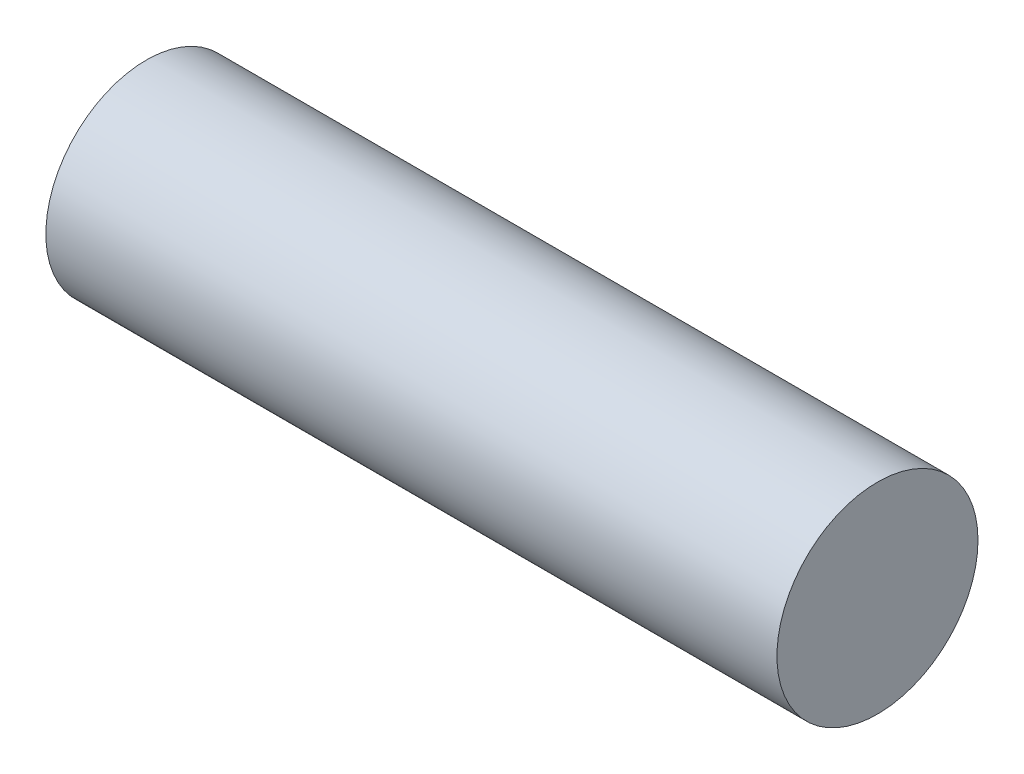
ISO-10303-21;
HEADER;
FILE_DESCRIPTION(('STEP AP214'),'2;1');
FILE_NAME('part.step','',(''),(''),'','','');
FILE_SCHEMA(('AUTOMOTIVE_DESIGN { 1 0 10303 214 1 1 1 1 }'));
ENDSEC;
DATA;
#1=APPLICATION_CONTEXT('core data for automotive mechanical design processes');
#2=APPLICATION_PROTOCOL_DEFINITION('international standard','automotive_design',2000,#1);
#3=PRODUCT_CONTEXT('',#1,'mechanical');
#4=PRODUCT('Part','Part','',(#3));
#5=PRODUCT_RELATED_PRODUCT_CATEGORY('part','',(#4));
#6=PRODUCT_DEFINITION_FORMATION('','',#4);
#7=PRODUCT_DEFINITION_CONTEXT('part definition',#1,'design');
#8=PRODUCT_DEFINITION('design','',#6,#7);
#9=PRODUCT_DEFINITION_SHAPE('','',#8);
#10=(LENGTH_UNIT() NAMED_UNIT(*) SI_UNIT(.MILLI.,.METRE.));
#11=(NAMED_UNIT(*) PLANE_ANGLE_UNIT() SI_UNIT($,.RADIAN.));
#12=(NAMED_UNIT(*) SI_UNIT($,.STERADIAN.) SOLID_ANGLE_UNIT());
#13=UNCERTAINTY_MEASURE_WITH_UNIT(LENGTH_MEASURE(1.E-05),#10,'distance_accuracy_value','');
#14=(GEOMETRIC_REPRESENTATION_CONTEXT(3) GLOBAL_UNCERTAINTY_ASSIGNED_CONTEXT((#13)) GLOBAL_UNIT_ASSIGNED_CONTEXT((#10,
#11,#12)) REPRESENTATION_CONTEXT('',''));
#15=CARTESIAN_POINT('',(0.,0.,0.));
#16=DIRECTION('',(0.,0.,1.));
#17=DIRECTION('',(1.,0.,0.));
#18=AXIS2_PLACEMENT_3D('',#15,#16,#17);
#19=CARTESIAN_POINT('',(400.,0.,0.));
#20=DIRECTION('',(-1.,0.,0.));
#21=DIRECTION('',(0.,0.,1.));
#22=AXIS2_PLACEMENT_3D('',#19,#20,#21);
#23=CYLINDRICAL_SURFACE('',#22,55.);
#24=CARTESIAN_POINT('',(400.,0.,0.));
#25=DIRECTION('',(1.,0.,0.));
#26=DIRECTION('',(0.,0.,-1.));
#27=AXIS2_PLACEMENT_3D('',#24,#25,#26);
#28=CIRCLE('',#27,55.);
#29=CARTESIAN_POINT('',(400.,0.,-55.));
#30=VERTEX_POINT('',#29);
#31=EDGE_CURVE('E10',#30,#30,#28,.T.);
#32=ORIENTED_EDGE('',*,*,#31,.F.);
#33=EDGE_LOOP('',(#32));
#34=FACE_BOUND('',#33,.T.);
#35=CARTESIAN_POINT('',(0.,0.,0.));
#36=DIRECTION('',(1.,0.,0.));
#37=DIRECTION('',(0.,0.,-1.));
#38=AXIS2_PLACEMENT_3D('',#35,#36,#37);
#39=CIRCLE('',#38,55.);
#40=CARTESIAN_POINT('',(0.,0.,-55.));
#41=VERTEX_POINT('',#40);
#42=EDGE_CURVE('E42',#41,#41,#39,.T.);
#43=ORIENTED_EDGE('',*,*,#42,.T.);
#44=EDGE_LOOP('',(#43));
#45=FACE_BOUND('',#44,.T.);
#46=ADVANCED_FACE('F39',(#34,#45),#23,.T.);
#47=CARTESIAN_POINT('',(400.,0.,0.));
#48=DIRECTION('',(1.,0.,0.));
#49=DIRECTION('',(0.,0.,-1.));
#50=AXIS2_PLACEMENT_3D('',#47,#48,#49);
#51=PLANE('',#50);
#52=ORIENTED_EDGE('',*,*,#31,.T.);
#53=EDGE_LOOP('',(#52));
#54=FACE_BOUND('',#53,.T.);
#55=ADVANCED_FACE('F56',(#54),#51,.T.);
#56=CARTESIAN_POINT('',(0.,0.,0.));
#57=DIRECTION('',(1.,0.,0.));
#58=DIRECTION('',(0.,0.,-1.));
#59=AXIS2_PLACEMENT_3D('',#56,#57,#58);
#60=PLANE('',#59);
#61=ORIENTED_EDGE('',*,*,#42,.F.);
#62=EDGE_LOOP('',(#61));
#63=FACE_BOUND('',#62,.T.);
#64=ADVANCED_FACE('F54',(#63),#60,.F.);
#65=CLOSED_SHELL('',(#46,#55,#64));
#66=MANIFOLD_SOLID_BREP('B2',#65);
#67=ADVANCED_BREP_SHAPE_REPRESENTATION('',(#18,#66),#14);
#68=SHAPE_DEFINITION_REPRESENTATION(#9,#67);
ENDSEC;
END-ISO-10303-21;
